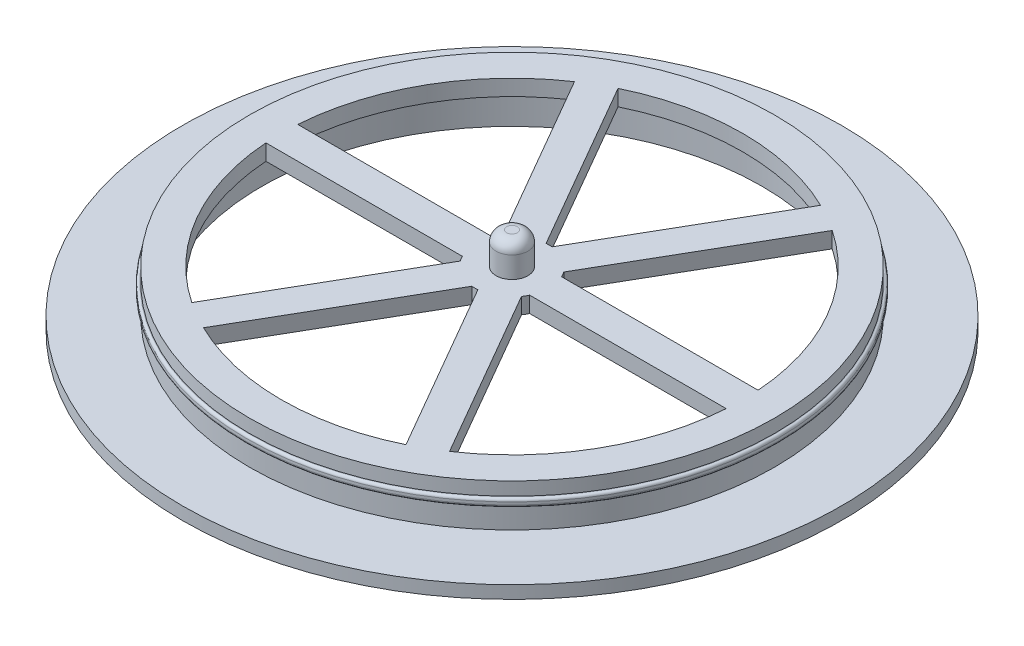
ISO-10303-21;
HEADER;
FILE_DESCRIPTION(('STEP AP214'),'2;1');
FILE_NAME('part.step','',(''),(''),'','','');
FILE_SCHEMA(('AUTOMOTIVE_DESIGN { 1 0 10303 214 1 1 1 1 }'));
ENDSEC;
DATA;
#1=APPLICATION_CONTEXT('core data for automotive mechanical design processes');
#2=APPLICATION_PROTOCOL_DEFINITION('international standard','automotive_design',2000,#1);
#3=PRODUCT_CONTEXT('',#1,'mechanical');
#4=PRODUCT('Part','Part','',(#3));
#5=PRODUCT_RELATED_PRODUCT_CATEGORY('part','',(#4));
#6=PRODUCT_DEFINITION_FORMATION('','',#4);
#7=PRODUCT_DEFINITION_CONTEXT('part definition',#1,'design');
#8=PRODUCT_DEFINITION('design','',#6,#7);
#9=PRODUCT_DEFINITION_SHAPE('','',#8);
#10=(LENGTH_UNIT() NAMED_UNIT(*) SI_UNIT(.MILLI.,.METRE.));
#11=(NAMED_UNIT(*) PLANE_ANGLE_UNIT() SI_UNIT($,.RADIAN.));
#12=(NAMED_UNIT(*) SI_UNIT($,.STERADIAN.) SOLID_ANGLE_UNIT());
#13=UNCERTAINTY_MEASURE_WITH_UNIT(LENGTH_MEASURE(1.E-05),#10,'distance_accuracy_value','');
#14=(GEOMETRIC_REPRESENTATION_CONTEXT(3) GLOBAL_UNCERTAINTY_ASSIGNED_CONTEXT((#13)) GLOBAL_UNIT_ASSIGNED_CONTEXT((#10,
#11,#12)) REPRESENTATION_CONTEXT('',''));
#15=CARTESIAN_POINT('',(0.,0.,0.));
#16=DIRECTION('',(0.,0.,1.));
#17=DIRECTION('',(1.,0.,0.));
#18=AXIS2_PLACEMENT_3D('',#15,#16,#17);
#19=CARTESIAN_POINT('',(0.,1.2,0.));
#20=DIRECTION('',(0.,-1.,0.));
#21=DIRECTION('',(0.,0.,-1.));
#22=AXIS2_PLACEMENT_3D('',#19,#20,#21);
#23=CYLINDRICAL_SURFACE('',#22,23.5);
#24=CARTESIAN_POINT('',(0.,0.,0.));
#25=DIRECTION('',(0.,1.,0.));
#26=DIRECTION('',(0.,0.,1.));
#27=AXIS2_PLACEMENT_3D('',#24,#25,#26);
#28=CIRCLE('',#27,23.5);
#29=CARTESIAN_POINT('',(0.,0.,23.5));
#30=VERTEX_POINT('',#29);
#31=EDGE_CURVE('E353',#30,#30,#28,.T.);
#32=ORIENTED_EDGE('',*,*,#31,.F.);
#33=EDGE_LOOP('',(#32));
#34=FACE_BOUND('',#33,.T.);
#35=CARTESIAN_POINT('',(0.,3.7,0.));
#36=DIRECTION('',(0.,1.,0.));
#37=DIRECTION('',(0.,0.,1.));
#38=AXIS2_PLACEMENT_3D('',#35,#36,#37);
#39=CIRCLE('',#38,23.5);
#40=CARTESIAN_POINT('',(0.,3.7,23.5));
#41=VERTEX_POINT('',#40);
#42=EDGE_CURVE('E269',#41,#41,#39,.F.);
#43=ORIENTED_EDGE('',*,*,#42,.F.);
#44=EDGE_LOOP('',(#43));
#45=FACE_BOUND('',#44,.T.);
#46=ADVANCED_FACE('F43',(#34,#45),#23,.F.);
#47=CARTESIAN_POINT('',(0.,3.7,1.49999999999999));
#48=DIRECTION('',(0.,0.,-1.));
#49=DIRECTION('',(-1.,0.,0.));
#50=AXIS2_PLACEMENT_3D('',#47,#48,#49);
#51=PLANE('',#50);
#52=DIRECTION('',(0.,1.,0.));
#53=VECTOR('',#52,1.);
#54=CARTESIAN_POINT('',(-21.6480946043757,3.7,1.5));
#55=LINE('',#54,#53);
#56=CARTESIAN_POINT('',(-21.6480946043757,3.7,1.5));
#57=VERTEX_POINT('',#56);
#58=CARTESIAN_POINT('',(-21.6480946043757,5.2,1.5));
#59=VERTEX_POINT('',#58);
#60=EDGE_CURVE('E274',#57,#59,#55,.T.);
#61=ORIENTED_EDGE('',*,*,#60,.F.);
#62=DIRECTION('',(-1.,0.,0.));
#63=VECTOR('',#62,1.);
#64=CARTESIAN_POINT('',(0.,3.7,1.49999999999999));
#65=LINE('',#64,#63);
#66=CARTESIAN_POINT('',(-3.16227766016838,3.7,1.49999999999999));
#67=VERTEX_POINT('',#66);
#68=EDGE_CURVE('E317',#67,#57,#65,.T.);
#69=ORIENTED_EDGE('',*,*,#68,.F.);
#70=DIRECTION('',(0.,1.,0.));
#71=VECTOR('',#70,1.);
#72=CARTESIAN_POINT('',(-3.16227766016838,3.7,1.49999999999999));
#73=LINE('',#72,#71);
#74=CARTESIAN_POINT('',(-3.16227766016838,5.2,1.49999999999999));
#75=VERTEX_POINT('',#74);
#76=EDGE_CURVE('E345',#67,#75,#73,.T.);
#77=ORIENTED_EDGE('',*,*,#76,.T.);
#78=DIRECTION('',(-1.,0.,0.));
#79=VECTOR('',#78,1.);
#80=CARTESIAN_POINT('',(0.,5.2,1.49999999999999));
#81=LINE('',#80,#79);
#82=EDGE_CURVE('E270',#75,#59,#81,.T.);
#83=ORIENTED_EDGE('',*,*,#82,.T.);
#84=EDGE_LOOP('',(#61,#69,#77,#83));
#85=FACE_BOUND('',#84,.T.);
#86=ADVANCED_FACE('F392',(#85),#51,.F.);
#87=CARTESIAN_POINT('',(0.,3.7,-1.50000000000001));
#88=DIRECTION('',(0.,0.,-1.));
#89=DIRECTION('',(-1.,0.,0.));
#90=AXIS2_PLACEMENT_3D('',#87,#88,#89);
#91=PLANE('',#90);
#92=DIRECTION('',(-1.,0.,0.));
#93=VECTOR('',#92,1.);
#94=CARTESIAN_POINT('',(0.,3.7,-1.50000000000001));
#95=LINE('',#94,#93);
#96=CARTESIAN_POINT('',(-3.16227766016838,3.7,-1.50000000000001));
#97=VERTEX_POINT('',#96);
#98=CARTESIAN_POINT('',(-21.6480946043757,3.7,-1.50000000000001));
#99=VERTEX_POINT('',#98);
#100=EDGE_CURVE('E267',#97,#99,#95,.T.);
#101=ORIENTED_EDGE('',*,*,#100,.T.);
#102=DIRECTION('',(0.,1.,0.));
#103=VECTOR('',#102,1.);
#104=CARTESIAN_POINT('',(-21.6480946043757,3.7,-1.50000000000001));
#105=LINE('',#104,#103);
#106=CARTESIAN_POINT('',(-21.6480946043757,5.2,-1.50000000000001));
#107=VERTEX_POINT('',#106);
#108=EDGE_CURVE('E58',#99,#107,#105,.T.);
#109=ORIENTED_EDGE('',*,*,#108,.T.);
#110=DIRECTION('',(-1.,0.,0.));
#111=VECTOR('',#110,1.);
#112=CARTESIAN_POINT('',(0.,5.2,-1.50000000000001));
#113=LINE('',#112,#111);
#114=CARTESIAN_POINT('',(-3.16227766016838,5.2,-1.50000000000001));
#115=VERTEX_POINT('',#114);
#116=EDGE_CURVE('E315',#115,#107,#113,.T.);
#117=ORIENTED_EDGE('',*,*,#116,.F.);
#118=DIRECTION('',(0.,1.,0.));
#119=VECTOR('',#118,1.);
#120=CARTESIAN_POINT('',(-3.16227766016838,3.7,-1.50000000000001));
#121=LINE('',#120,#119);
#122=EDGE_CURVE('E318',#97,#115,#121,.T.);
#123=ORIENTED_EDGE('',*,*,#122,.F.);
#124=EDGE_LOOP('',(#101,#109,#117,#123));
#125=FACE_BOUND('',#124,.T.);
#126=ADVANCED_FACE('F398',(#125),#91,.T.);
#127=CARTESIAN_POINT('',(-1.29903810567666,3.7,0.749999999999999));
#128=DIRECTION('',(0.86602540378444,0.,-0.499999999999998));
#129=DIRECTION('',(-0.499999999999998,0.,-0.86602540378444));
#130=AXIS2_PLACEMENT_3D('',#127,#128,#129);
#131=PLANE('',#130);
#132=DIRECTION('',(0.,1.,0.));
#133=VECTOR('',#132,1.);
#134=CARTESIAN_POINT('',(-12.1230854078645,3.7,-17.9977998709182));
#135=LINE('',#134,#133);
#136=CARTESIAN_POINT('',(-12.1230854078645,3.7,-17.9977998709182));
#137=VERTEX_POINT('',#136);
#138=CARTESIAN_POINT('',(-12.1230854078645,5.2,-17.9977998709182));
#139=VERTEX_POINT('',#138);
#140=EDGE_CURVE('E564',#137,#139,#135,.T.);
#141=ORIENTED_EDGE('',*,*,#140,.F.);
#142=DIRECTION('',(-0.499999999999998,0.,-0.86602540378444));
#143=VECTOR('',#142,1.);
#144=CARTESIAN_POINT('',(-1.29903810567666,3.7,0.749999999999999));
#145=LINE('',#144,#143);
#146=CARTESIAN_POINT('',(-2.88017693576085,3.7,-1.98861278752583));
#147=VERTEX_POINT('',#146);
#148=EDGE_CURVE('E261',#147,#137,#145,.T.);
#149=ORIENTED_EDGE('',*,*,#148,.F.);
#150=DIRECTION('',(0.,1.,0.));
#151=VECTOR('',#150,1.);
#152=CARTESIAN_POINT('',(-2.88017693576085,3.7,-1.98861278752583));
#153=LINE('',#152,#151);
#154=CARTESIAN_POINT('',(-2.88017693576085,5.2,-1.98861278752583));
#155=VERTEX_POINT('',#154);
#156=EDGE_CURVE('E321',#147,#155,#153,.T.);
#157=ORIENTED_EDGE('',*,*,#156,.T.);
#158=DIRECTION('',(-0.499999999999998,0.,-0.86602540378444));
#159=VECTOR('',#158,1.);
#160=CARTESIAN_POINT('',(-1.29903810567666,5.2,0.749999999999999));
#161=LINE('',#160,#159);
#162=EDGE_CURVE('E310',#155,#139,#161,.T.);
#163=ORIENTED_EDGE('',*,*,#162,.T.);
#164=EDGE_LOOP('',(#141,#149,#157,#163));
#165=FACE_BOUND('',#164,.T.);
#166=ADVANCED_FACE('F515',(#165),#131,.F.);
#167=CARTESIAN_POINT('',(1.29903810567666,3.7,-0.749999999999998));
#168=DIRECTION('',(0.86602540378444,0.,-0.499999999999998));
#169=DIRECTION('',(-0.499999999999998,0.,-0.86602540378444));
#170=AXIS2_PLACEMENT_3D('',#167,#168,#169);
#171=PLANE('',#170);
#172=DIRECTION('',(-0.499999999999998,0.,-0.86602540378444));
#173=VECTOR('',#172,1.);
#174=CARTESIAN_POINT('',(1.29903810567666,3.7,-0.749999999999998));
#175=LINE('',#174,#173);
#176=CARTESIAN_POINT('',(-0.282100724407525,3.7,-3.48861278752583));
#177=VERTEX_POINT('',#176);
#178=CARTESIAN_POINT('',(-9.52500919651115,3.7,-19.4977998709182));
#179=VERTEX_POINT('',#178);
#180=EDGE_CURVE('E258',#177,#179,#175,.T.);
#181=ORIENTED_EDGE('',*,*,#180,.T.);
#182=DIRECTION('',(0.,1.,0.));
#183=VECTOR('',#182,1.);
#184=CARTESIAN_POINT('',(-9.52500919651115,3.7,-19.4977998709182));
#185=LINE('',#184,#183);
#186=CARTESIAN_POINT('',(-9.52500919651115,5.2,-19.4977998709182));
#187=VERTEX_POINT('',#186);
#188=EDGE_CURVE('E561',#179,#187,#185,.T.);
#189=ORIENTED_EDGE('',*,*,#188,.T.);
#190=DIRECTION('',(-0.499999999999998,0.,-0.86602540378444));
#191=VECTOR('',#190,1.);
#192=CARTESIAN_POINT('',(1.29903810567666,5.2,-0.749999999999998));
#193=LINE('',#192,#191);
#194=CARTESIAN_POINT('',(-0.282100724407525,5.2,-3.48861278752583));
#195=VERTEX_POINT('',#194);
#196=EDGE_CURVE('E307',#195,#187,#193,.T.);
#197=ORIENTED_EDGE('',*,*,#196,.F.);
#198=DIRECTION('',(0.,1.,0.));
#199=VECTOR('',#198,1.);
#200=CARTESIAN_POINT('',(-0.282100724407525,3.7,-3.48861278752583));
#201=LINE('',#200,#199);
#202=EDGE_CURVE('E323',#177,#195,#201,.T.);
#203=ORIENTED_EDGE('',*,*,#202,.F.);
#204=EDGE_LOOP('',(#181,#189,#197,#203));
#205=FACE_BOUND('',#204,.T.);
#206=ADVANCED_FACE('F508',(#205),#171,.T.);
#207=CARTESIAN_POINT('',(-1.29963709716943,3.7,-0.7503458278996));
#208=DIRECTION('',(-0.866025403784437,0.,-0.500000000000003));
#209=DIRECTION('',(-0.500000000000003,0.,0.866025403784437));
#210=AXIS2_PLACEMENT_3D('',#207,#208,#209);
#211=PLANE('',#210);
#212=DIRECTION('',(-0.500000000000004,0.,0.866025403784437));
#213=VECTOR('',#212,1.);
#214=CARTESIAN_POINT('',(-1.29963709716943,5.2,-0.7503458278996));
#215=LINE('',#214,#213);
#216=CARTESIAN_POINT('',(9.52438623699589,5.2,-19.4981041849848));
#217=VERTEX_POINT('',#216);
#218=CARTESIAN_POINT('',(0.281337646004448,5.2,-3.48867440855988));
#219=VERTEX_POINT('',#218);
#220=EDGE_CURVE('E302',#217,#219,#215,.T.);
#221=ORIENTED_EDGE('',*,*,#220,.F.);
#222=DIRECTION('',(0.,1.,0.));
#223=VECTOR('',#222,1.);
#224=CARTESIAN_POINT('',(9.52438623699589,3.7,-19.4981041849848));
#225=LINE('',#224,#223);
#226=CARTESIAN_POINT('',(9.52438623699589,3.7,-19.4981041849848));
#227=VERTEX_POINT('',#226);
#228=EDGE_CURVE('E558',#217,#227,#225,.F.);
#229=ORIENTED_EDGE('',*,*,#228,.T.);
#230=DIRECTION('',(-0.500000000000004,0.,0.866025403784437));
#231=VECTOR('',#230,1.);
#232=CARTESIAN_POINT('',(-1.29963709716943,3.7,-0.7503458278996));
#233=LINE('',#232,#231);
#234=CARTESIAN_POINT('',(0.281337646004448,3.7,-3.48867440855988));
#235=VERTEX_POINT('',#234);
#236=EDGE_CURVE('E253',#227,#235,#233,.T.);
#237=ORIENTED_EDGE('',*,*,#236,.T.);
#238=DIRECTION('',(0.,1.,0.));
#239=VECTOR('',#238,1.);
#240=CARTESIAN_POINT('',(0.281337646004448,3.7,-3.48867440855988));
#241=LINE('',#240,#239);
#242=EDGE_CURVE('E325',#235,#219,#241,.T.);
#243=ORIENTED_EDGE('',*,*,#242,.T.);
#244=EDGE_LOOP('',(#221,#229,#237,#243));
#245=FACE_BOUND('',#244,.T.);
#246=ADVANCED_FACE('F504',(#245),#211,.T.);
#247=CARTESIAN_POINT('',(1.29843911418389,3.7,0.749654172100413));
#248=DIRECTION('',(0.866025403784437,0.,0.500000000000003));
#249=DIRECTION('',(0.500000000000003,0.,-0.866025403784437));
#250=AXIS2_PLACEMENT_3D('',#247,#248,#249);
#251=PLANE('',#250);
#252=DIRECTION('',(0.500000000000004,0.,-0.866025403784437));
#253=VECTOR('',#252,1.);
#254=CARTESIAN_POINT('',(1.29843911418389,3.7,0.749654172100413));
#255=LINE('',#254,#253);
#256=CARTESIAN_POINT('',(2.87974193851972,3.7,-1.98924266180139));
#257=VERTEX_POINT('',#256);
#258=CARTESIAN_POINT('',(12.1225103732922,3.7,-17.998187193421));
#259=VERTEX_POINT('',#258);
#260=EDGE_CURVE('E250',#257,#259,#255,.T.);
#261=ORIENTED_EDGE('',*,*,#260,.T.);
#262=DIRECTION('',(0.,1.,0.));
#263=VECTOR('',#262,1.);
#264=CARTESIAN_POINT('',(12.1225103732922,3.7,-17.998187193421));
#265=LINE('',#264,#263);
#266=CARTESIAN_POINT('',(12.1225103732922,5.2,-17.998187193421));
#267=VERTEX_POINT('',#266);
#268=EDGE_CURVE('E555',#259,#267,#265,.T.);
#269=ORIENTED_EDGE('',*,*,#268,.T.);
#270=DIRECTION('',(0.500000000000004,0.,-0.866025403784437));
#271=VECTOR('',#270,1.);
#272=CARTESIAN_POINT('',(1.29843911418389,5.2,0.749654172100413));
#273=LINE('',#272,#271);
#274=CARTESIAN_POINT('',(2.87974193851972,5.2,-1.98924266180139));
#275=VERTEX_POINT('',#274);
#276=EDGE_CURVE('E299',#275,#267,#273,.T.);
#277=ORIENTED_EDGE('',*,*,#276,.F.);
#278=DIRECTION('',(0.,1.,0.));
#279=VECTOR('',#278,1.);
#280=CARTESIAN_POINT('',(2.87974193851972,3.7,-1.98924266180139));
#281=LINE('',#280,#279);
#282=EDGE_CURVE('E328',#257,#275,#281,.T.);
#283=ORIENTED_EDGE('',*,*,#282,.F.);
#284=EDGE_LOOP('',(#261,#269,#277,#283));
#285=FACE_BOUND('',#284,.T.);
#286=ADVANCED_FACE('F497',(#285),#251,.T.);
#287=CARTESIAN_POINT('',(0.,3.7,-1.50000000000001));
#288=DIRECTION('',(0.,0.,-1.));
#289=DIRECTION('',(-1.,0.,0.));
#290=AXIS2_PLACEMENT_3D('',#287,#288,#289);
#291=PLANE('',#290);
#292=DIRECTION('',(-1.,0.,0.));
#293=VECTOR('',#292,1.);
#294=CARTESIAN_POINT('',(0.,5.2,-1.50000000000001));
#295=LINE('',#294,#293);
#296=CARTESIAN_POINT('',(21.6480946043757,5.2,-1.50000000000001));
#297=VERTEX_POINT('',#296);
#298=CARTESIAN_POINT('',(3.16227766016838,5.2,-1.50000000000001));
#299=VERTEX_POINT('',#298);
#300=EDGE_CURVE('E294',#297,#299,#295,.T.);
#301=ORIENTED_EDGE('',*,*,#300,.F.);
#302=DIRECTION('',(0.,1.,0.));
#303=VECTOR('',#302,1.);
#304=CARTESIAN_POINT('',(21.6480946043757,3.7,-1.50000000000001));
#305=LINE('',#304,#303);
#306=CARTESIAN_POINT('',(21.6480946043757,3.7,-1.50000000000001));
#307=VERTEX_POINT('',#306);
#308=EDGE_CURVE('E552',#297,#307,#305,.F.);
#309=ORIENTED_EDGE('',*,*,#308,.T.);
#310=DIRECTION('',(-1.,0.,0.));
#311=VECTOR('',#310,1.);
#312=CARTESIAN_POINT('',(0.,3.7,-1.50000000000001));
#313=LINE('',#312,#311);
#314=CARTESIAN_POINT('',(3.16227766016838,3.7,-1.50000000000001));
#315=VERTEX_POINT('',#314);
#316=EDGE_CURVE('E245',#307,#315,#313,.T.);
#317=ORIENTED_EDGE('',*,*,#316,.T.);
#318=DIRECTION('',(0.,1.,0.));
#319=VECTOR('',#318,1.);
#320=CARTESIAN_POINT('',(3.16227766016838,3.7,-1.50000000000001));
#321=LINE('',#320,#319);
#322=EDGE_CURVE('E330',#315,#299,#321,.T.);
#323=ORIENTED_EDGE('',*,*,#322,.T.);
#324=EDGE_LOOP('',(#301,#309,#317,#323));
#325=FACE_BOUND('',#324,.T.);
#326=ADVANCED_FACE('F493',(#325),#291,.T.);
#327=CARTESIAN_POINT('',(0.,3.7,1.49999999999999));
#328=DIRECTION('',(0.,0.,-1.));
#329=DIRECTION('',(-1.,0.,0.));
#330=AXIS2_PLACEMENT_3D('',#327,#328,#329);
#331=PLANE('',#330);
#332=DIRECTION('',(0.,1.,0.));
#333=VECTOR('',#332,1.);
#334=CARTESIAN_POINT('',(21.6480946043757,3.7,1.5));
#335=LINE('',#334,#333);
#336=CARTESIAN_POINT('',(21.6480946043757,5.2,1.5));
#337=VERTEX_POINT('',#336);
#338=CARTESIAN_POINT('',(21.6480946043757,3.7,1.5));
#339=VERTEX_POINT('',#338);
#340=EDGE_CURVE('E550',#337,#339,#335,.F.);
#341=ORIENTED_EDGE('',*,*,#340,.F.);
#342=DIRECTION('',(-1.,0.,0.));
#343=VECTOR('',#342,1.);
#344=CARTESIAN_POINT('',(0.,5.2,1.49999999999999));
#345=LINE('',#344,#343);
#346=CARTESIAN_POINT('',(3.16227766016838,5.2,1.49999999999999));
#347=VERTEX_POINT('',#346);
#348=EDGE_CURVE('E292',#337,#347,#345,.T.);
#349=ORIENTED_EDGE('',*,*,#348,.T.);
#350=DIRECTION('',(0.,1.,0.));
#351=VECTOR('',#350,1.);
#352=CARTESIAN_POINT('',(3.16227766016838,3.7,1.49999999999999));
#353=LINE('',#352,#351);
#354=CARTESIAN_POINT('',(3.16227766016838,3.7,1.49999999999999));
#355=VERTEX_POINT('',#354);
#356=EDGE_CURVE('E333',#355,#347,#353,.T.);
#357=ORIENTED_EDGE('',*,*,#356,.F.);
#358=DIRECTION('',(-1.,0.,0.));
#359=VECTOR('',#358,1.);
#360=CARTESIAN_POINT('',(0.,3.7,1.49999999999999));
#361=LINE('',#360,#359);
#362=EDGE_CURVE('E243',#339,#355,#361,.T.);
#363=ORIENTED_EDGE('',*,*,#362,.F.);
#364=EDGE_LOOP('',(#341,#349,#357,#363));
#365=FACE_BOUND('',#364,.T.);
#366=ADVANCED_FACE('F485',(#365),#331,.F.);
#367=CARTESIAN_POINT('',(1.29903810567666,3.7,-0.749999999999997));
#368=DIRECTION('',(0.866025403784439,0.,-0.499999999999999));
#369=DIRECTION('',(-0.499999999999999,0.,-0.866025403784439));
#370=AXIS2_PLACEMENT_3D('',#367,#368,#369);
#371=PLANE('',#370);
#372=DIRECTION('',(-0.499999999999999,0.,-0.86602540378444));
#373=VECTOR('',#372,1.);
#374=CARTESIAN_POINT('',(1.29903810567666,5.2,-0.749999999999997));
#375=LINE('',#374,#373);
#376=CARTESIAN_POINT('',(12.1230854078645,5.2,17.9977998709182));
#377=VERTEX_POINT('',#376);
#378=CARTESIAN_POINT('',(2.88017693576084,5.2,1.98861278752584));
#379=VERTEX_POINT('',#378);
#380=EDGE_CURVE('E287',#377,#379,#375,.T.);
#381=ORIENTED_EDGE('',*,*,#380,.F.);
#382=DIRECTION('',(0.,1.,0.));
#383=VECTOR('',#382,1.);
#384=CARTESIAN_POINT('',(12.1230854078645,3.7,17.9977998709182));
#385=LINE('',#384,#383);
#386=CARTESIAN_POINT('',(12.1230854078645,3.7,17.9977998709182));
#387=VERTEX_POINT('',#386);
#388=EDGE_CURVE('E214',#377,#387,#385,.F.);
#389=ORIENTED_EDGE('',*,*,#388,.T.);
#390=DIRECTION('',(-0.499999999999999,0.,-0.86602540378444));
#391=VECTOR('',#390,1.);
#392=CARTESIAN_POINT('',(1.29903810567666,3.7,-0.749999999999997));
#393=LINE('',#392,#391);
#394=CARTESIAN_POINT('',(2.88017693576084,3.7,1.98861278752584));
#395=VERTEX_POINT('',#394);
#396=EDGE_CURVE('E233',#387,#395,#393,.T.);
#397=ORIENTED_EDGE('',*,*,#396,.T.);
#398=DIRECTION('',(0.,1.,0.));
#399=VECTOR('',#398,1.);
#400=CARTESIAN_POINT('',(2.88017693576084,3.7,1.98861278752584));
#401=LINE('',#400,#399);
#402=EDGE_CURVE('E336',#395,#379,#401,.T.);
#403=ORIENTED_EDGE('',*,*,#402,.T.);
#404=EDGE_LOOP('',(#381,#389,#397,#403));
#405=FACE_BOUND('',#404,.T.);
#406=ADVANCED_FACE('F482',(#405),#371,.T.);
#407=CARTESIAN_POINT('',(-1.29903810567666,3.7,0.749999999999999));
#408=DIRECTION('',(0.866025403784439,0.,-0.499999999999999));
#409=DIRECTION('',(-0.499999999999999,0.,-0.866025403784439));
#410=AXIS2_PLACEMENT_3D('',#407,#408,#409);
#411=PLANE('',#410);
#412=DIRECTION('',(0.,1.,0.));
#413=VECTOR('',#412,1.);
#414=CARTESIAN_POINT('',(9.52500919651115,3.7,19.4977998709182));
#415=LINE('',#414,#413);
#416=CARTESIAN_POINT('',(9.52500919651115,5.2,19.4977998709182));
#417=VERTEX_POINT('',#416);
#418=CARTESIAN_POINT('',(9.52500919651116,3.7,19.4977998709182));
#419=VERTEX_POINT('',#418);
#420=EDGE_CURVE('E204',#417,#419,#415,.F.);
#421=ORIENTED_EDGE('',*,*,#420,.F.);
#422=DIRECTION('',(-0.499999999999999,0.,-0.86602540378444));
#423=VECTOR('',#422,1.);
#424=CARTESIAN_POINT('',(-1.29903810567666,5.2,0.749999999999999));
#425=LINE('',#424,#423);
#426=CARTESIAN_POINT('',(0.282100724407523,5.2,3.48861278752583));
#427=VERTEX_POINT('',#426);
#428=EDGE_CURVE('E285',#417,#427,#425,.T.);
#429=ORIENTED_EDGE('',*,*,#428,.T.);
#430=DIRECTION('',(0.,1.,0.));
#431=VECTOR('',#430,1.);
#432=CARTESIAN_POINT('',(0.282100724407523,3.7,3.48861278752583));
#433=LINE('',#432,#431);
#434=CARTESIAN_POINT('',(0.282100724407523,3.7,3.48861278752583));
#435=VERTEX_POINT('',#434);
#436=EDGE_CURVE('E231',#435,#427,#433,.T.);
#437=ORIENTED_EDGE('',*,*,#436,.F.);
#438=DIRECTION('',(-0.499999999999999,0.,-0.86602540378444));
#439=VECTOR('',#438,1.);
#440=CARTESIAN_POINT('',(-1.29903810567666,3.7,0.749999999999999));
#441=LINE('',#440,#439);
#442=EDGE_CURVE('E222',#419,#435,#441,.T.);
#443=ORIENTED_EDGE('',*,*,#442,.F.);
#444=EDGE_LOOP('',(#421,#429,#437,#443));
#445=FACE_BOUND('',#444,.T.);
#446=ADVANCED_FACE('F229',(#445),#411,.F.);
#447=CARTESIAN_POINT('',(1.29843911418388,3.7,0.749654172100412));
#448=DIRECTION('',(0.866025403784437,0.,0.500000000000003));
#449=DIRECTION('',(0.500000000000003,0.,-0.866025403784437));
#450=AXIS2_PLACEMENT_3D('',#447,#448,#449);
#451=PLANE('',#450);
#452=DIRECTION('',(0.500000000000004,0.,-0.866025403784437));
#453=VECTOR('',#452,1.);
#454=CARTESIAN_POINT('',(1.29843911418388,5.2,0.749654172100412));
#455=LINE('',#454,#453);
#456=CARTESIAN_POINT('',(-9.5256321449244,5.2,19.4974955376218));
#457=VERTEX_POINT('',#456);
#458=CARTESIAN_POINT('',(-0.282863710151951,5.2,3.48855100600222));
#459=VERTEX_POINT('',#458);
#460=EDGE_CURVE('E280',#457,#459,#455,.T.);
#461=ORIENTED_EDGE('',*,*,#460,.F.);
#462=DIRECTION('',(0.,1.,0.));
#463=VECTOR('',#462,1.);
#464=CARTESIAN_POINT('',(-9.5256321449244,3.7,19.4974955376218));
#465=LINE('',#464,#463);
#466=CARTESIAN_POINT('',(-9.52563214492441,3.7,19.4974955376218));
#467=VERTEX_POINT('',#466);
#468=EDGE_CURVE('E215',#457,#467,#465,.F.);
#469=ORIENTED_EDGE('',*,*,#468,.T.);
#470=DIRECTION('',(0.500000000000004,0.,-0.866025403784437));
#471=VECTOR('',#470,1.);
#472=CARTESIAN_POINT('',(1.29843911418388,3.7,0.749654172100412));
#473=LINE('',#472,#471);
#474=CARTESIAN_POINT('',(-0.282863710151951,3.7,3.48855100600222));
#475=VERTEX_POINT('',#474);
#476=EDGE_CURVE('E224',#467,#475,#473,.T.);
#477=ORIENTED_EDGE('',*,*,#476,.T.);
#478=DIRECTION('',(0.,1.,0.));
#479=VECTOR('',#478,1.);
#480=CARTESIAN_POINT('',(-0.282863710151951,3.7,3.48855100600222));
#481=LINE('',#480,#479);
#482=EDGE_CURVE('E340',#475,#459,#481,.T.);
#483=ORIENTED_EDGE('',*,*,#482,.T.);
#484=EDGE_LOOP('',(#461,#469,#477,#483));
#485=FACE_BOUND('',#484,.T.);
#486=ADVANCED_FACE('F471',(#485),#451,.T.);
#487=CARTESIAN_POINT('',(-1.29963709716943,3.7,-0.750345827899602));
#488=DIRECTION('',(-0.866025403784436,0.,-0.500000000000004));
#489=DIRECTION('',(-0.500000000000004,0.,0.866025403784437));
#490=AXIS2_PLACEMENT_3D('',#487,#488,#489);
#491=PLANE('',#490);
#492=DIRECTION('',(-0.500000000000004,0.,0.866025403784437));
#493=VECTOR('',#492,1.);
#494=CARTESIAN_POINT('',(-1.29963709716943,3.7,-0.750345827899602));
#495=LINE('',#494,#493);
#496=CARTESIAN_POINT('',(-2.88061184034331,3.7,1.98798275276068));
#497=VERTEX_POINT('',#496);
#498=CARTESIAN_POINT('',(-12.1236604313348,3.7,17.9974125291856));
#499=VERTEX_POINT('',#498);
#500=EDGE_CURVE('E574',#497,#499,#495,.T.);
#501=ORIENTED_EDGE('',*,*,#500,.T.);
#502=DIRECTION('',(0.,1.,0.));
#503=VECTOR('',#502,1.);
#504=CARTESIAN_POINT('',(-12.1236604313348,3.7,17.9974125291856));
#505=LINE('',#504,#503);
#506=CARTESIAN_POINT('',(-12.1236604313348,5.2,17.9974125291856));
#507=VERTEX_POINT('',#506);
#508=EDGE_CURVE('E545',#499,#507,#505,.T.);
#509=ORIENTED_EDGE('',*,*,#508,.T.);
#510=DIRECTION('',(-0.500000000000004,0.,0.866025403784437));
#511=VECTOR('',#510,1.);
#512=CARTESIAN_POINT('',(-1.29963709716943,5.2,-0.750345827899602));
#513=LINE('',#512,#511);
#514=CARTESIAN_POINT('',(-2.88061184034331,5.2,1.98798275276068));
#515=VERTEX_POINT('',#514);
#516=EDGE_CURVE('E277',#515,#507,#513,.T.);
#517=ORIENTED_EDGE('',*,*,#516,.F.);
#518=DIRECTION('',(0.,1.,0.));
#519=VECTOR('',#518,1.);
#520=CARTESIAN_POINT('',(-2.88061184034331,3.7,1.98798275276068));
#521=LINE('',#520,#519);
#522=EDGE_CURVE('E343',#497,#515,#521,.T.);
#523=ORIENTED_EDGE('',*,*,#522,.F.);
#524=EDGE_LOOP('',(#501,#509,#517,#523));
#525=FACE_BOUND('',#524,.T.);
#526=ADVANCED_FACE('F468',(#525),#491,.T.);
#527=CARTESIAN_POINT('',(0.,5.2,0.));
#528=DIRECTION('',(0.,-1.,0.));
#529=DIRECTION('',(0.,0.,-1.));
#530=AXIS2_PLACEMENT_3D('',#527,#528,#529);
#531=CYLINDRICAL_SURFACE('',#530,24.7);
#532=CARTESIAN_POINT('',(0.,1.2,0.));
#533=DIRECTION('',(0.,1.,0.));
#534=DIRECTION('',(0.,0.,1.));
#535=AXIS2_PLACEMENT_3D('',#532,#533,#534);
#536=CIRCLE('',#535,24.7);
#537=CARTESIAN_POINT('',(0.,1.2,24.7));
#538=VERTEX_POINT('',#537);
#539=EDGE_CURVE('E349',#538,#538,#536,.T.);
#540=ORIENTED_EDGE('',*,*,#539,.T.);
#541=EDGE_LOOP('',(#540));
#542=FACE_BOUND('',#541,.T.);
#543=CARTESIAN_POINT('',(0.,3.2,0.));
#544=DIRECTION('',(0.,1.,0.));
#545=DIRECTION('',(0.,0.,1.));
#546=AXIS2_PLACEMENT_3D('',#543,#544,#545);
#547=CIRCLE('',#546,24.7);
#548=CARTESIAN_POINT('',(0.,3.2,24.7));
#549=VERTEX_POINT('',#548);
#550=EDGE_CURVE('E362',#549,#549,#547,.T.);
#551=ORIENTED_EDGE('',*,*,#550,.F.);
#552=EDGE_LOOP('',(#551));
#553=FACE_BOUND('',#552,.T.);
#554=ADVANCED_FACE('F411',(#542,#553),#531,.T.);
#555=CARTESIAN_POINT('',(0.,1.2,0.));
#556=DIRECTION('',(0.,1.,0.));
#557=DIRECTION('',(0.,0.,1.));
#558=AXIS2_PLACEMENT_3D('',#555,#556,#557);
#559=PLANE('',#558);
#560=CARTESIAN_POINT('',(0.,1.2,0.));
#561=DIRECTION('',(0.,1.,0.));
#562=DIRECTION('',(0.,0.,1.));
#563=AXIS2_PLACEMENT_3D('',#560,#561,#562);
#564=CIRCLE('',#563,31.);
#565=CARTESIAN_POINT('',(0.,1.2,31.));
#566=VERTEX_POINT('',#565);
#567=EDGE_CURVE('E359',#566,#566,#564,.T.);
#568=ORIENTED_EDGE('',*,*,#567,.T.);
#569=EDGE_LOOP('',(#568));
#570=FACE_BOUND('',#569,.T.);
#571=ORIENTED_EDGE('',*,*,#539,.F.);
#572=EDGE_LOOP('',(#571));
#573=FACE_BOUND('',#572,.T.);
#574=ADVANCED_FACE('F407',(#570,#573),#559,.T.);
#575=CARTESIAN_POINT('',(0.,0.,0.));
#576=DIRECTION('',(0.,1.,0.));
#577=DIRECTION('',(0.,0.,1.));
#578=AXIS2_PLACEMENT_3D('',#575,#576,#577);
#579=PLANE('',#578);
#580=CARTESIAN_POINT('',(0.,0.,0.));
#581=DIRECTION('',(0.,1.,0.));
#582=DIRECTION('',(0.,0.,1.));
#583=AXIS2_PLACEMENT_3D('',#580,#581,#582);
#584=CIRCLE('',#583,31.);
#585=CARTESIAN_POINT('',(0.,0.,31.));
#586=VERTEX_POINT('',#585);
#587=EDGE_CURVE('E358',#586,#586,#584,.T.);
#588=ORIENTED_EDGE('',*,*,#587,.F.);
#589=EDGE_LOOP('',(#588));
#590=FACE_BOUND('',#589,.T.);
#591=ORIENTED_EDGE('',*,*,#31,.T.);
#592=EDGE_LOOP('',(#591));
#593=FACE_BOUND('',#592,.T.);
#594=ADVANCED_FACE('F410',(#590,#593),#579,.F.);
#595=CARTESIAN_POINT('',(0.,1.2,0.));
#596=DIRECTION('',(0.,-1.,0.));
#597=DIRECTION('',(0.,0.,-1.));
#598=AXIS2_PLACEMENT_3D('',#595,#596,#597);
#599=CYLINDRICAL_SURFACE('',#598,31.);
#600=ORIENTED_EDGE('',*,*,#567,.F.);
#601=EDGE_LOOP('',(#600));
#602=FACE_BOUND('',#601,.T.);
#603=ORIENTED_EDGE('',*,*,#587,.T.);
#604=EDGE_LOOP('',(#603));
#605=FACE_BOUND('',#604,.T.);
#606=ADVANCED_FACE('F415',(#602,#605),#599,.T.);
#607=CARTESIAN_POINT('',(0.,5.2,0.));
#608=DIRECTION('',(0.,1.,0.));
#609=DIRECTION('',(0.,0.,1.));
#610=AXIS2_PLACEMENT_3D('',#607,#608,#609);
#611=PLANE('',#610);
#612=CARTESIAN_POINT('',(0.,5.2,0.));
#613=DIRECTION('',(0.,1.,0.));
#614=DIRECTION('',(0.,0.,1.));
#615=AXIS2_PLACEMENT_3D('',#612,#613,#614);
#616=CIRCLE('',#615,1.5);
#617=CARTESIAN_POINT('',(0.,5.2,1.5));
#618=VERTEX_POINT('',#617);
#619=EDGE_CURVE('E541',#618,#618,#616,.T.);
#620=ORIENTED_EDGE('',*,*,#619,.F.);
#621=EDGE_LOOP('',(#620));
#622=FACE_BOUND('',#621,.T.);
#623=CARTESIAN_POINT('',(0.,5.2,0.));
#624=DIRECTION('',(0.,1.,0.));
#625=DIRECTION('',(0.,0.,1.));
#626=AXIS2_PLACEMENT_3D('',#623,#624,#625);
#627=CIRCLE('',#626,21.7);
#628=EDGE_CURVE('E226',#377,#337,#627,.T.);
#629=ORIENTED_EDGE('',*,*,#628,.F.);
#630=ORIENTED_EDGE('',*,*,#380,.T.);
#631=CARTESIAN_POINT('',(0.,5.2,0.));
#632=DIRECTION('',(0.,1.,0.));
#633=DIRECTION('',(0.,0.,1.));
#634=AXIS2_PLACEMENT_3D('',#631,#632,#633);
#635=CIRCLE('',#634,3.5);
#636=EDGE_CURVE('E289',#379,#347,#635,.T.);
#637=ORIENTED_EDGE('',*,*,#636,.T.);
#638=ORIENTED_EDGE('',*,*,#348,.F.);
#639=EDGE_LOOP('',(#629,#630,#637,#638));
#640=FACE_BOUND('',#639,.T.);
#641=EDGE_CURVE('E612',#297,#267,#627,.T.);
#642=ORIENTED_EDGE('',*,*,#641,.F.);
#643=ORIENTED_EDGE('',*,*,#300,.T.);
#644=CARTESIAN_POINT('',(0.,5.2,0.));
#645=DIRECTION('',(0.,1.,0.));
#646=DIRECTION('',(0.,0.,1.));
#647=AXIS2_PLACEMENT_3D('',#644,#645,#646);
#648=CIRCLE('',#647,3.5);
#649=EDGE_CURVE('E296',#299,#275,#648,.T.);
#650=ORIENTED_EDGE('',*,*,#649,.T.);
#651=ORIENTED_EDGE('',*,*,#276,.T.);
#652=EDGE_LOOP('',(#642,#643,#650,#651));
#653=FACE_BOUND('',#652,.T.);
#654=EDGE_CURVE('E613',#217,#187,#627,.T.);
#655=ORIENTED_EDGE('',*,*,#654,.F.);
#656=ORIENTED_EDGE('',*,*,#220,.T.);
#657=CARTESIAN_POINT('',(0.,5.2,0.));
#658=DIRECTION('',(0.,1.,0.));
#659=DIRECTION('',(0.,0.,1.));
#660=AXIS2_PLACEMENT_3D('',#657,#658,#659);
#661=CIRCLE('',#660,3.5);
#662=EDGE_CURVE('E304',#219,#195,#661,.T.);
#663=ORIENTED_EDGE('',*,*,#662,.T.);
#664=ORIENTED_EDGE('',*,*,#196,.T.);
#665=EDGE_LOOP('',(#655,#656,#663,#664));
#666=FACE_BOUND('',#665,.T.);
#667=EDGE_CURVE('E615',#139,#107,#627,.T.);
#668=ORIENTED_EDGE('',*,*,#667,.F.);
#669=ORIENTED_EDGE('',*,*,#162,.F.);
#670=CARTESIAN_POINT('',(0.,5.2,0.));
#671=DIRECTION('',(0.,1.,0.));
#672=DIRECTION('',(0.,0.,1.));
#673=AXIS2_PLACEMENT_3D('',#670,#671,#672);
#674=CIRCLE('',#673,3.5);
#675=EDGE_CURVE('E312',#155,#115,#674,.T.);
#676=ORIENTED_EDGE('',*,*,#675,.T.);
#677=ORIENTED_EDGE('',*,*,#116,.T.);
#678=EDGE_LOOP('',(#668,#669,#676,#677));
#679=FACE_BOUND('',#678,.T.);
#680=EDGE_CURVE('E66',#59,#507,#627,.T.);
#681=ORIENTED_EDGE('',*,*,#680,.F.);
#682=ORIENTED_EDGE('',*,*,#82,.F.);
#683=CARTESIAN_POINT('',(0.,5.2,0.));
#684=DIRECTION('',(0.,1.,0.));
#685=DIRECTION('',(0.,0.,1.));
#686=AXIS2_PLACEMENT_3D('',#683,#684,#685);
#687=CIRCLE('',#686,3.5);
#688=EDGE_CURVE('E273',#75,#515,#687,.T.);
#689=ORIENTED_EDGE('',*,*,#688,.T.);
#690=ORIENTED_EDGE('',*,*,#516,.T.);
#691=EDGE_LOOP('',(#681,#682,#689,#690));
#692=FACE_BOUND('',#691,.T.);
#693=ORIENTED_EDGE('',*,*,#428,.F.);
#694=EDGE_CURVE('E210',#457,#417,#627,.T.);
#695=ORIENTED_EDGE('',*,*,#694,.F.);
#696=ORIENTED_EDGE('',*,*,#460,.T.);
#697=CARTESIAN_POINT('',(0.,5.2,0.));
#698=DIRECTION('',(0.,1.,0.));
#699=DIRECTION('',(0.,0.,1.));
#700=AXIS2_PLACEMENT_3D('',#697,#698,#699);
#701=CIRCLE('',#700,3.5);
#702=EDGE_CURVE('E282',#459,#427,#701,.T.);
#703=ORIENTED_EDGE('',*,*,#702,.T.);
#704=EDGE_LOOP('',(#693,#695,#696,#703));
#705=FACE_BOUND('',#704,.T.);
#706=CARTESIAN_POINT('',(0.,5.2,0.));
#707=DIRECTION('',(0.,1.,0.));
#708=DIRECTION('',(0.,0.,1.));
#709=AXIS2_PLACEMENT_3D('',#706,#707,#708);
#710=CIRCLE('',#709,24.7);
#711=CARTESIAN_POINT('',(0.,5.2,24.7));
#712=VERTEX_POINT('',#711);
#713=EDGE_CURVE('E350',#712,#712,#710,.T.);
#714=ORIENTED_EDGE('',*,*,#713,.T.);
#715=EDGE_LOOP('',(#714));
#716=FACE_BOUND('',#715,.T.);
#717=ADVANCED_FACE('F419',(#622,#640,#653,#666,#679,#692,#705,#716),#611,.T.);
#718=CARTESIAN_POINT('',(0.,3.95,0.));
#719=DIRECTION('',(0.,1.,0.));
#720=DIRECTION('',(0.,0.,1.));
#721=AXIS2_PLACEMENT_3D('',#718,#719,#720);
#722=CIRCLE('',#721,24.7);
#723=CARTESIAN_POINT('',(0.,3.95,24.7));
#724=VERTEX_POINT('',#723);
#725=EDGE_CURVE('E320',#724,#724,#722,.T.);
#726=ORIENTED_EDGE('',*,*,#725,.T.);
#727=EDGE_LOOP('',(#726));
#728=FACE_BOUND('',#727,.T.);
#729=ORIENTED_EDGE('',*,*,#713,.F.);
#730=EDGE_LOOP('',(#729));
#731=FACE_BOUND('',#730,.T.);
#732=ADVANCED_FACE('F405',(#728,#731),#531,.T.);
#733=CARTESIAN_POINT('',(0.,3.95,0.));
#734=DIRECTION('',(0.,1.,0.));
#735=DIRECTION('',(0.,0.,1.));
#736=AXIS2_PLACEMENT_3D('',#733,#734,#735);
#737=PLANE('',#736);
#738=CARTESIAN_POINT('',(0.,3.95,0.));
#739=DIRECTION('',(0.,1.,0.));
#740=DIRECTION('',(0.,0.,1.));
#741=AXIS2_PLACEMENT_3D('',#738,#739,#740);
#742=CIRCLE('',#741,24.75);
#743=CARTESIAN_POINT('',(0.,3.95,24.75));
#744=VERTEX_POINT('',#743);
#745=EDGE_CURVE('E376',#744,#744,#742,.T.);
#746=ORIENTED_EDGE('',*,*,#745,.T.);
#747=EDGE_LOOP('',(#746));
#748=FACE_BOUND('',#747,.T.);
#749=ORIENTED_EDGE('',*,*,#725,.F.);
#750=EDGE_LOOP('',(#749));
#751=FACE_BOUND('',#750,.T.);
#752=ADVANCED_FACE('F439',(#748,#751),#737,.T.);
#753=CARTESIAN_POINT('',(0.,3.2,0.));
#754=DIRECTION('',(0.,1.,0.));
#755=DIRECTION('',(0.,0.,1.));
#756=AXIS2_PLACEMENT_3D('',#753,#754,#755);
#757=PLANE('',#756);
#758=CARTESIAN_POINT('',(0.,3.2,0.));
#759=DIRECTION('',(0.,1.,0.));
#760=DIRECTION('',(0.,0.,1.));
#761=AXIS2_PLACEMENT_3D('',#758,#759,#760);
#762=CIRCLE('',#761,24.75);
#763=CARTESIAN_POINT('',(0.,3.2,24.75));
#764=VERTEX_POINT('',#763);
#765=EDGE_CURVE('E373',#764,#764,#762,.F.);
#766=ORIENTED_EDGE('',*,*,#765,.T.);
#767=EDGE_LOOP('',(#766));
#768=FACE_BOUND('',#767,.T.);
#769=ORIENTED_EDGE('',*,*,#550,.T.);
#770=EDGE_LOOP('',(#769));
#771=FACE_BOUND('',#770,.T.);
#772=ADVANCED_FACE('F442',(#768,#771),#757,.F.);
#773=CARTESIAN_POINT('',(0.,3.95,0.));
#774=DIRECTION('',(0.,-1.,0.));
#775=DIRECTION('',(0.,0.,-1.));
#776=AXIS2_PLACEMENT_3D('',#773,#774,#775);
#777=CYLINDRICAL_SURFACE('',#776,25.);
#778=CARTESIAN_POINT('',(0.,3.45,0.));
#779=DIRECTION('',(0.,1.,0.));
#780=DIRECTION('',(0.,0.,1.));
#781=AXIS2_PLACEMENT_3D('',#778,#779,#780);
#782=CIRCLE('',#781,25.);
#783=CARTESIAN_POINT('',(0.,3.45,25.));
#784=VERTEX_POINT('',#783);
#785=EDGE_CURVE('E370',#784,#784,#782,.T.);
#786=ORIENTED_EDGE('',*,*,#785,.T.);
#787=EDGE_LOOP('',(#786));
#788=FACE_BOUND('',#787,.T.);
#789=CARTESIAN_POINT('',(0.,3.7,0.));
#790=DIRECTION('',(0.,1.,0.));
#791=DIRECTION('',(0.,0.,1.));
#792=AXIS2_PLACEMENT_3D('',#789,#790,#791);
#793=CIRCLE('',#792,25.);
#794=CARTESIAN_POINT('',(0.,3.7,25.));
#795=VERTEX_POINT('',#794);
#796=EDGE_CURVE('E367',#795,#795,#793,.F.);
#797=ORIENTED_EDGE('',*,*,#796,.T.);
#798=EDGE_LOOP('',(#797));
#799=FACE_BOUND('',#798,.T.);
#800=ADVANCED_FACE('F424',(#788,#799),#777,.T.);
#801=CARTESIAN_POINT('',(0.,3.45,0.));
#802=DIRECTION('',(0.,1.,0.));
#803=DIRECTION('',(0.,0.,1.));
#804=AXIS2_PLACEMENT_3D('',#801,#802,#803);
#805=TOROIDAL_SURFACE('',#804,24.75,0.25);
#806=ORIENTED_EDGE('',*,*,#765,.F.);
#807=EDGE_LOOP('',(#806));
#808=FACE_BOUND('',#807,.T.);
#809=ORIENTED_EDGE('',*,*,#785,.F.);
#810=EDGE_LOOP('',(#809));
#811=FACE_BOUND('',#810,.T.);
#812=ADVANCED_FACE('F421',(#808,#811),#805,.T.);
#813=CARTESIAN_POINT('',(0.,3.7,0.));
#814=DIRECTION('',(0.,1.,0.));
#815=DIRECTION('',(0.,0.,1.));
#816=AXIS2_PLACEMENT_3D('',#813,#814,#815);
#817=TOROIDAL_SURFACE('',#816,24.75,0.25);
#818=ORIENTED_EDGE('',*,*,#796,.F.);
#819=EDGE_LOOP('',(#818));
#820=FACE_BOUND('',#819,.T.);
#821=ORIENTED_EDGE('',*,*,#745,.F.);
#822=EDGE_LOOP('',(#821));
#823=FACE_BOUND('',#822,.T.);
#824=ADVANCED_FACE('F423',(#820,#823),#817,.T.);
#825=CARTESIAN_POINT('',(0.,3.7,0.));
#826=DIRECTION('',(0.,1.,0.));
#827=DIRECTION('',(0.,0.,1.));
#828=AXIS2_PLACEMENT_3D('',#825,#826,#827);
#829=CYLINDRICAL_SURFACE('',#828,3.5);
#830=ORIENTED_EDGE('',*,*,#675,.F.);
#831=ORIENTED_EDGE('',*,*,#156,.F.);
#832=CARTESIAN_POINT('',(0.,3.7,0.));
#833=DIRECTION('',(0.,1.,0.));
#834=DIRECTION('',(0.,0.,1.));
#835=AXIS2_PLACEMENT_3D('',#832,#833,#834);
#836=CIRCLE('',#835,3.5);
#837=EDGE_CURVE('E264',#147,#97,#836,.T.);
#838=ORIENTED_EDGE('',*,*,#837,.T.);
#839=ORIENTED_EDGE('',*,*,#122,.T.);
#840=EDGE_LOOP('',(#830,#831,#838,#839));
#841=FACE_BOUND('',#840,.T.);
#842=ADVANCED_FACE('F427',(#841),#829,.T.);
#843=CARTESIAN_POINT('',(0.,3.7,0.));
#844=DIRECTION('',(0.,1.,0.));
#845=DIRECTION('',(0.,0.,1.));
#846=AXIS2_PLACEMENT_3D('',#843,#844,#845);
#847=CYLINDRICAL_SURFACE('',#846,3.5);
#848=ORIENTED_EDGE('',*,*,#662,.F.);
#849=ORIENTED_EDGE('',*,*,#242,.F.);
#850=CARTESIAN_POINT('',(0.,3.7,0.));
#851=DIRECTION('',(0.,1.,0.));
#852=DIRECTION('',(0.,0.,1.));
#853=AXIS2_PLACEMENT_3D('',#850,#851,#852);
#854=CIRCLE('',#853,3.5);
#855=EDGE_CURVE('E255',#235,#177,#854,.T.);
#856=ORIENTED_EDGE('',*,*,#855,.T.);
#857=ORIENTED_EDGE('',*,*,#202,.T.);
#858=EDGE_LOOP('',(#848,#849,#856,#857));
#859=FACE_BOUND('',#858,.T.);
#860=ADVANCED_FACE('F432',(#859),#847,.T.);
#861=CARTESIAN_POINT('',(0.,3.7,0.));
#862=DIRECTION('',(0.,1.,0.));
#863=DIRECTION('',(0.,0.,1.));
#864=AXIS2_PLACEMENT_3D('',#861,#862,#863);
#865=CYLINDRICAL_SURFACE('',#864,3.5);
#866=ORIENTED_EDGE('',*,*,#649,.F.);
#867=ORIENTED_EDGE('',*,*,#322,.F.);
#868=CARTESIAN_POINT('',(0.,3.7,0.));
#869=DIRECTION('',(0.,1.,0.));
#870=DIRECTION('',(0.,0.,1.));
#871=AXIS2_PLACEMENT_3D('',#868,#869,#870);
#872=CIRCLE('',#871,3.5);
#873=EDGE_CURVE('E247',#315,#257,#872,.T.);
#874=ORIENTED_EDGE('',*,*,#873,.T.);
#875=ORIENTED_EDGE('',*,*,#282,.T.);
#876=EDGE_LOOP('',(#866,#867,#874,#875));
#877=FACE_BOUND('',#876,.T.);
#878=ADVANCED_FACE('F489',(#877),#865,.T.);
#879=CARTESIAN_POINT('',(0.,3.7,0.));
#880=DIRECTION('',(0.,1.,0.));
#881=DIRECTION('',(0.,0.,1.));
#882=AXIS2_PLACEMENT_3D('',#879,#880,#881);
#883=CYLINDRICAL_SURFACE('',#882,3.5);
#884=ORIENTED_EDGE('',*,*,#636,.F.);
#885=ORIENTED_EDGE('',*,*,#402,.F.);
#886=CARTESIAN_POINT('',(0.,3.7,0.));
#887=DIRECTION('',(0.,1.,0.));
#888=DIRECTION('',(0.,0.,1.));
#889=AXIS2_PLACEMENT_3D('',#886,#887,#888);
#890=CIRCLE('',#889,3.5);
#891=EDGE_CURVE('E236',#395,#355,#890,.T.);
#892=ORIENTED_EDGE('',*,*,#891,.T.);
#893=ORIENTED_EDGE('',*,*,#356,.T.);
#894=EDGE_LOOP('',(#884,#885,#892,#893));
#895=FACE_BOUND('',#894,.T.);
#896=ADVANCED_FACE('F478',(#895),#883,.T.);
#897=CARTESIAN_POINT('',(0.,3.7,0.));
#898=DIRECTION('',(0.,1.,0.));
#899=DIRECTION('',(0.,0.,1.));
#900=AXIS2_PLACEMENT_3D('',#897,#898,#899);
#901=CYLINDRICAL_SURFACE('',#900,3.5);
#902=ORIENTED_EDGE('',*,*,#702,.F.);
#903=ORIENTED_EDGE('',*,*,#482,.F.);
#904=CARTESIAN_POINT('',(0.,3.7,0.));
#905=DIRECTION('',(0.,1.,0.));
#906=DIRECTION('',(0.,0.,1.));
#907=AXIS2_PLACEMENT_3D('',#904,#905,#906);
#908=CIRCLE('',#907,3.5);
#909=EDGE_CURVE('E234',#475,#435,#908,.T.);
#910=ORIENTED_EDGE('',*,*,#909,.T.);
#911=ORIENTED_EDGE('',*,*,#436,.T.);
#912=EDGE_LOOP('',(#902,#903,#910,#911));
#913=FACE_BOUND('',#912,.T.);
#914=ADVANCED_FACE('F466',(#913),#901,.T.);
#915=CARTESIAN_POINT('',(0.,3.7,0.));
#916=DIRECTION('',(0.,1.,0.));
#917=DIRECTION('',(0.,0.,1.));
#918=AXIS2_PLACEMENT_3D('',#915,#916,#917);
#919=CYLINDRICAL_SURFACE('',#918,3.5);
#920=ORIENTED_EDGE('',*,*,#688,.F.);
#921=ORIENTED_EDGE('',*,*,#76,.F.);
#922=CARTESIAN_POINT('',(0.,3.7,0.));
#923=DIRECTION('',(0.,1.,0.));
#924=DIRECTION('',(0.,0.,1.));
#925=AXIS2_PLACEMENT_3D('',#922,#923,#924);
#926=CIRCLE('',#925,3.5);
#927=EDGE_CURVE('E571',#67,#497,#926,.T.);
#928=ORIENTED_EDGE('',*,*,#927,.T.);
#929=ORIENTED_EDGE('',*,*,#522,.T.);
#930=EDGE_LOOP('',(#920,#921,#928,#929));
#931=FACE_BOUND('',#930,.T.);
#932=ADVANCED_FACE('F463',(#931),#919,.T.);
#933=CARTESIAN_POINT('',(0.,3.7,0.));
#934=DIRECTION('',(0.,1.,0.));
#935=DIRECTION('',(0.,0.,1.));
#936=AXIS2_PLACEMENT_3D('',#933,#934,#935);
#937=PLANE('',#936);
#938=ORIENTED_EDGE('',*,*,#42,.T.);
#939=EDGE_LOOP('',(#938));
#940=FACE_BOUND('',#939,.T.);
#941=ORIENTED_EDGE('',*,*,#68,.T.);
#942=CARTESIAN_POINT('',(0.,3.7,0.));
#943=DIRECTION('',(0.,1.,0.));
#944=DIRECTION('',(0.,0.,1.));
#945=AXIS2_PLACEMENT_3D('',#942,#943,#944);
#946=CIRCLE('',#945,21.7);
#947=EDGE_CURVE('E225',#57,#499,#946,.T.);
#948=ORIENTED_EDGE('',*,*,#947,.T.);
#949=ORIENTED_EDGE('',*,*,#500,.F.);
#950=ORIENTED_EDGE('',*,*,#927,.F.);
#951=EDGE_LOOP('',(#941,#948,#949,#950));
#952=FACE_BOUND('',#951,.T.);
#953=EDGE_CURVE('E592',#137,#99,#946,.T.);
#954=ORIENTED_EDGE('',*,*,#953,.T.);
#955=ORIENTED_EDGE('',*,*,#100,.F.);
#956=ORIENTED_EDGE('',*,*,#837,.F.);
#957=ORIENTED_EDGE('',*,*,#148,.T.);
#958=EDGE_LOOP('',(#954,#955,#956,#957));
#959=FACE_BOUND('',#958,.T.);
#960=EDGE_CURVE('E597',#227,#179,#946,.T.);
#961=ORIENTED_EDGE('',*,*,#960,.T.);
#962=ORIENTED_EDGE('',*,*,#180,.F.);
#963=ORIENTED_EDGE('',*,*,#855,.F.);
#964=ORIENTED_EDGE('',*,*,#236,.F.);
#965=EDGE_LOOP('',(#961,#962,#963,#964));
#966=FACE_BOUND('',#965,.T.);
#967=EDGE_CURVE('E228',#387,#339,#946,.T.);
#968=ORIENTED_EDGE('',*,*,#967,.T.);
#969=ORIENTED_EDGE('',*,*,#362,.T.);
#970=ORIENTED_EDGE('',*,*,#891,.F.);
#971=ORIENTED_EDGE('',*,*,#396,.F.);
#972=EDGE_LOOP('',(#968,#969,#970,#971));
#973=FACE_BOUND('',#972,.T.);
#974=EDGE_CURVE('E207',#467,#419,#946,.T.);
#975=ORIENTED_EDGE('',*,*,#974,.T.);
#976=ORIENTED_EDGE('',*,*,#442,.T.);
#977=ORIENTED_EDGE('',*,*,#909,.F.);
#978=ORIENTED_EDGE('',*,*,#476,.F.);
#979=EDGE_LOOP('',(#975,#976,#977,#978));
#980=FACE_BOUND('',#979,.T.);
#981=EDGE_CURVE('E604',#307,#259,#946,.T.);
#982=ORIENTED_EDGE('',*,*,#981,.T.);
#983=ORIENTED_EDGE('',*,*,#260,.F.);
#984=ORIENTED_EDGE('',*,*,#873,.F.);
#985=ORIENTED_EDGE('',*,*,#316,.F.);
#986=EDGE_LOOP('',(#982,#983,#984,#985));
#987=FACE_BOUND('',#986,.T.);
#988=ADVANCED_FACE('F219',(#940,#952,#959,#966,#973,#980,#987),#937,.F.);
#989=CARTESIAN_POINT('',(0.,3.7,0.));
#990=DIRECTION('',(0.,1.,0.));
#991=DIRECTION('',(0.,0.,1.));
#992=AXIS2_PLACEMENT_3D('',#989,#990,#991);
#993=CYLINDRICAL_SURFACE('',#992,21.7);
#994=ORIENTED_EDGE('',*,*,#947,.F.);
#995=ORIENTED_EDGE('',*,*,#60,.T.);
#996=ORIENTED_EDGE('',*,*,#680,.T.);
#997=ORIENTED_EDGE('',*,*,#508,.F.);
#998=EDGE_LOOP('',(#994,#995,#996,#997));
#999=FACE_BOUND('',#998,.T.);
#1000=ADVANCED_FACE('F524',(#999),#993,.F.);
#1001=ORIENTED_EDGE('',*,*,#694,.T.);
#1002=ORIENTED_EDGE('',*,*,#420,.T.);
#1003=ORIENTED_EDGE('',*,*,#974,.F.);
#1004=ORIENTED_EDGE('',*,*,#468,.F.);
#1005=EDGE_LOOP('',(#1001,#1002,#1003,#1004));
#1006=FACE_BOUND('',#1005,.T.);
#1007=ADVANCED_FACE('F206',(#1006),#993,.F.);
#1008=ORIENTED_EDGE('',*,*,#628,.T.);
#1009=ORIENTED_EDGE('',*,*,#340,.T.);
#1010=ORIENTED_EDGE('',*,*,#967,.F.);
#1011=ORIENTED_EDGE('',*,*,#388,.F.);
#1012=EDGE_LOOP('',(#1008,#1009,#1010,#1011));
#1013=FACE_BOUND('',#1012,.T.);
#1014=ADVANCED_FACE('F530',(#1013),#993,.F.);
#1015=ORIENTED_EDGE('',*,*,#268,.F.);
#1016=ORIENTED_EDGE('',*,*,#981,.F.);
#1017=ORIENTED_EDGE('',*,*,#308,.F.);
#1018=ORIENTED_EDGE('',*,*,#641,.T.);
#1019=EDGE_LOOP('',(#1015,#1016,#1017,#1018));
#1020=FACE_BOUND('',#1019,.T.);
#1021=ADVANCED_FACE('F526',(#1020),#993,.F.);
#1022=ORIENTED_EDGE('',*,*,#188,.F.);
#1023=ORIENTED_EDGE('',*,*,#960,.F.);
#1024=ORIENTED_EDGE('',*,*,#228,.F.);
#1025=ORIENTED_EDGE('',*,*,#654,.T.);
#1026=EDGE_LOOP('',(#1022,#1023,#1024,#1025));
#1027=FACE_BOUND('',#1026,.T.);
#1028=ADVANCED_FACE('F529',(#1027),#993,.F.);
#1029=ORIENTED_EDGE('',*,*,#108,.F.);
#1030=ORIENTED_EDGE('',*,*,#953,.F.);
#1031=ORIENTED_EDGE('',*,*,#140,.T.);
#1032=ORIENTED_EDGE('',*,*,#667,.T.);
#1033=EDGE_LOOP('',(#1029,#1030,#1031,#1032));
#1034=FACE_BOUND('',#1033,.T.);
#1035=ADVANCED_FACE('F533',(#1034),#993,.F.);
#1036=CARTESIAN_POINT('',(0.,8.2,0.));
#1037=DIRECTION('',(0.,-1.,0.));
#1038=DIRECTION('',(0.,0.,-1.));
#1039=AXIS2_PLACEMENT_3D('',#1036,#1037,#1038);
#1040=CYLINDRICAL_SURFACE('',#1039,1.5);
#1041=CARTESIAN_POINT('',(0.,7.2,0.));
#1042=DIRECTION('',(0.,1.,0.));
#1043=DIRECTION('',(0.,0.,1.));
#1044=AXIS2_PLACEMENT_3D('',#1041,#1042,#1043);
#1045=CIRCLE('',#1044,1.5);
#1046=CARTESIAN_POINT('',(0.,7.2,1.5));
#1047=VERTEX_POINT('',#1046);
#1048=EDGE_CURVE('E12',#1047,#1047,#1045,.F.);
#1049=ORIENTED_EDGE('',*,*,#1048,.T.);
#1050=EDGE_LOOP('',(#1049));
#1051=FACE_BOUND('',#1050,.T.);
#1052=ORIENTED_EDGE('',*,*,#619,.T.);
#1053=EDGE_LOOP('',(#1052));
#1054=FACE_BOUND('',#1053,.T.);
#1055=ADVANCED_FACE('F388',(#1051,#1054),#1040,.T.);
#1056=CARTESIAN_POINT('',(0.,8.2,0.));
#1057=DIRECTION('',(0.,1.,0.));
#1058=DIRECTION('',(0.,0.,1.));
#1059=AXIS2_PLACEMENT_3D('',#1056,#1057,#1058);
#1060=PLANE('',#1059);
#1061=CARTESIAN_POINT('',(0.,8.2,0.));
#1062=DIRECTION('',(0.,1.,0.));
#1063=DIRECTION('',(0.,0.,1.));
#1064=AXIS2_PLACEMENT_3D('',#1061,#1062,#1063);
#1065=CIRCLE('',#1064,0.5);
#1066=CARTESIAN_POINT('',(0.,8.2,0.5));
#1067=VERTEX_POINT('',#1066);
#1068=EDGE_CURVE('E51',#1067,#1067,#1065,.T.);
#1069=ORIENTED_EDGE('',*,*,#1068,.T.);
#1070=EDGE_LOOP('',(#1069));
#1071=FACE_BOUND('',#1070,.T.);
#1072=ADVANCED_FACE('F381',(#1071),#1060,.T.);
#1073=CARTESIAN_POINT('',(0.,7.2,0.));
#1074=DIRECTION('',(0.,1.,0.));
#1075=DIRECTION('',(0.,0.,1.));
#1076=AXIS2_PLACEMENT_3D('',#1073,#1074,#1075);
#1077=DEGENERATE_TOROIDAL_SURFACE('',#1076,0.5,1.,.T.);
#1078=ORIENTED_EDGE('',*,*,#1048,.F.);
#1079=EDGE_LOOP('',(#1078));
#1080=FACE_BOUND('',#1079,.T.);
#1081=ORIENTED_EDGE('',*,*,#1068,.F.);
#1082=EDGE_LOOP('',(#1081));
#1083=FACE_BOUND('',#1082,.T.);
#1084=ADVANCED_FACE('F45',(#1080,#1083),#1077,.T.);
#1085=CLOSED_SHELL('',(#46,#86,#126,#166,#206,#246,#286,#326,#366,#406,#446,#486,#526,#554,#574,
#594,#606,#717,#732,#752,#772,#800,#812,#824,#842,#860,#878,#896,#914,#932,#988,#1000,#1007,
#1014,#1021,#1028,#1035,#1055,#1072,#1084));
#1086=MANIFOLD_SOLID_BREP('B2',#1085);
#1087=ADVANCED_BREP_SHAPE_REPRESENTATION('',(#18,#1086),#14);
#1088=SHAPE_DEFINITION_REPRESENTATION(#9,#1087);
ENDSEC;
END-ISO-10303-21;
